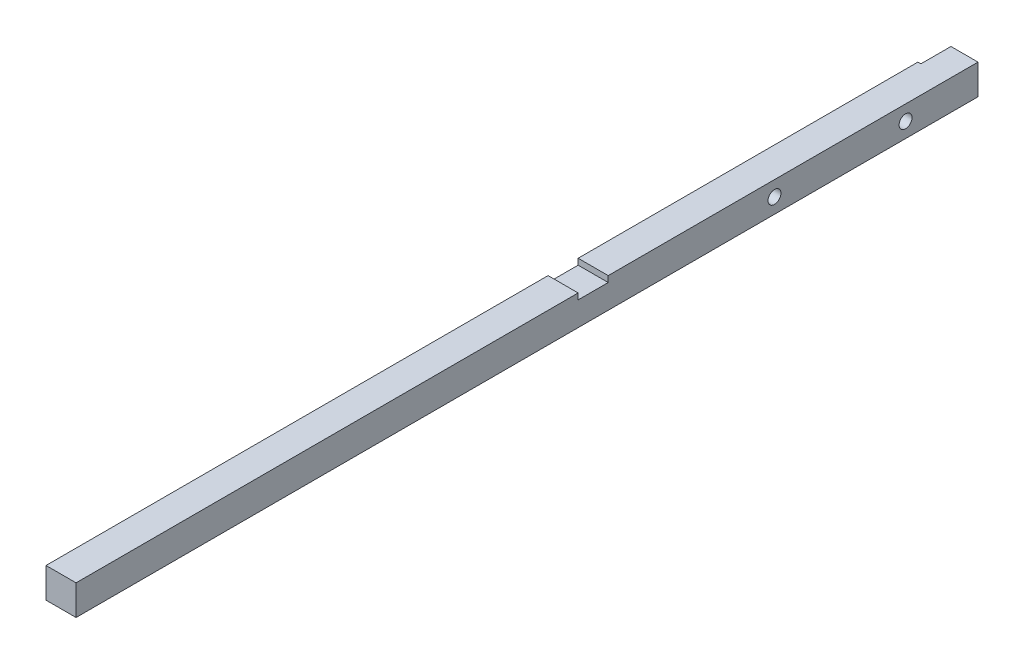
ISO-10303-21;
HEADER;
FILE_DESCRIPTION(('STEP AP214'),'2;1');
FILE_NAME('part.step','',(''),(''),'','','');
FILE_SCHEMA(('AUTOMOTIVE_DESIGN { 1 0 10303 214 1 1 1 1 }'));
ENDSEC;
DATA;
#1=APPLICATION_CONTEXT('core data for automotive mechanical design processes');
#2=APPLICATION_PROTOCOL_DEFINITION('international standard','automotive_design',2000,#1);
#3=PRODUCT_CONTEXT('',#1,'mechanical');
#4=PRODUCT('Part','Part','',(#3));
#5=PRODUCT_RELATED_PRODUCT_CATEGORY('part','',(#4));
#6=PRODUCT_DEFINITION_FORMATION('','',#4);
#7=PRODUCT_DEFINITION_CONTEXT('part definition',#1,'design');
#8=PRODUCT_DEFINITION('design','',#6,#7);
#9=PRODUCT_DEFINITION_SHAPE('','',#8);
#10=(LENGTH_UNIT() NAMED_UNIT(*) SI_UNIT(.MILLI.,.METRE.));
#11=(NAMED_UNIT(*) PLANE_ANGLE_UNIT() SI_UNIT($,.RADIAN.));
#12=(NAMED_UNIT(*) SI_UNIT($,.STERADIAN.) SOLID_ANGLE_UNIT());
#13=UNCERTAINTY_MEASURE_WITH_UNIT(LENGTH_MEASURE(1.E-05),#10,'distance_accuracy_value','');
#14=(GEOMETRIC_REPRESENTATION_CONTEXT(3) GLOBAL_UNCERTAINTY_ASSIGNED_CONTEXT((#13)) GLOBAL_UNIT_ASSIGNED_CONTEXT((#10,
#11,#12)) REPRESENTATION_CONTEXT('',''));
#15=CARTESIAN_POINT('',(0.,0.,0.));
#16=DIRECTION('',(0.,0.,1.));
#17=DIRECTION('',(1.,0.,0.));
#18=AXIS2_PLACEMENT_3D('',#15,#16,#17);
#19=CARTESIAN_POINT('',(-5.,5.,323.142135623731));
#20=DIRECTION('',(0.,-1.,0.));
#21=DIRECTION('',(0.,0.,-1.));
#22=AXIS2_PLACEMENT_3D('',#19,#20,#21);
#23=PLANE('',#22);
#24=DIRECTION('',(0.,0.,-1.));
#25=VECTOR('',#24,1.);
#26=CARTESIAN_POINT('',(5.,5.,323.142135623731));
#27=LINE('',#26,#25);
#28=CARTESIAN_POINT('',(5.,5.,307.));
#29=VERTEX_POINT('',#28);
#30=CARTESIAN_POINT('',(5.,5.,140.));
#31=VERTEX_POINT('',#30);
#32=EDGE_CURVE('E156',#29,#31,#27,.T.);
#33=ORIENTED_EDGE('',*,*,#32,.T.);
#34=DIRECTION('',(1.,0.,0.));
#35=VECTOR('',#34,1.);
#36=CARTESIAN_POINT('',(-5.,5.,140.));
#37=LINE('',#36,#35);
#38=CARTESIAN_POINT('',(-5.,5.,140.));
#39=VERTEX_POINT('',#38);
#40=EDGE_CURVE('E196',#39,#31,#37,.T.);
#41=ORIENTED_EDGE('',*,*,#40,.F.);
#42=DIRECTION('',(0.,0.,-1.));
#43=VECTOR('',#42,1.);
#44=CARTESIAN_POINT('',(-5.,5.,323.142135623731));
#45=LINE('',#44,#43);
#46=CARTESIAN_POINT('',(-5.,5.,307.));
#47=VERTEX_POINT('',#46);
#48=EDGE_CURVE('E42',#47,#39,#45,.T.);
#49=ORIENTED_EDGE('',*,*,#48,.F.);
#50=DIRECTION('',(-1.,0.,0.));
#51=VECTOR('',#50,1.);
#52=CARTESIAN_POINT('',(-5.,5.,307.));
#53=LINE('',#52,#51);
#54=EDGE_CURVE('E153',#29,#47,#53,.T.);
#55=ORIENTED_EDGE('',*,*,#54,.F.);
#56=EDGE_LOOP('',(#33,#41,#49,#55));
#57=FACE_BOUND('',#56,.T.);
#58=ADVANCED_FACE('F38',(#57),#23,.F.);
#59=CARTESIAN_POINT('',(-5.,5.,323.142135623731));
#60=DIRECTION('',(1.,0.,0.));
#61=DIRECTION('',(0.,1.,0.));
#62=AXIS2_PLACEMENT_3D('',#59,#60,#61);
#63=PLANE('',#62);
#64=CARTESIAN_POINT('',(-5.,0.,74.69));
#65=DIRECTION('',(-1.,0.,0.));
#66=DIRECTION('',(0.,0.,1.));
#67=AXIS2_PLACEMENT_3D('',#64,#65,#66);
#68=CIRCLE('',#67,2.14999999999999);
#69=CARTESIAN_POINT('',(-5.,0.,76.84));
#70=VERTEX_POINT('',#69);
#71=EDGE_CURVE('E260',#70,#70,#68,.T.);
#72=ORIENTED_EDGE('',*,*,#71,.F.);
#73=EDGE_LOOP('',(#72));
#74=FACE_BOUND('',#73,.T.);
#75=CARTESIAN_POINT('',(-5.,0.,31.09));
#76=DIRECTION('',(-1.,0.,0.));
#77=DIRECTION('',(0.,0.,1.));
#78=AXIS2_PLACEMENT_3D('',#75,#76,#77);
#79=CIRCLE('',#78,2.14999999999999);
#80=CARTESIAN_POINT('',(-5.,0.,33.24));
#81=VERTEX_POINT('',#80);
#82=EDGE_CURVE('E254',#81,#81,#79,.T.);
#83=ORIENTED_EDGE('',*,*,#82,.F.);
#84=EDGE_LOOP('',(#83));
#85=FACE_BOUND('',#84,.T.);
#86=CARTESIAN_POINT('',(-5.,5.,130.));
#87=VERTEX_POINT('',#86);
#88=CARTESIAN_POINT('',(-5.,4.99999999999999,17.));
#89=VERTEX_POINT('',#88);
#90=EDGE_CURVE('E198',#87,#89,#45,.T.);
#91=ORIENTED_EDGE('',*,*,#90,.T.);
#92=DIRECTION('',(0.,1.,0.));
#93=VECTOR('',#92,1.);
#94=CARTESIAN_POINT('',(-5.,-5.,17.));
#95=LINE('',#94,#93);
#96=CARTESIAN_POINT('',(-5.,-5.,17.));
#97=VERTEX_POINT('',#96);
#98=EDGE_CURVE('E125',#97,#89,#95,.T.);
#99=ORIENTED_EDGE('',*,*,#98,.F.);
#100=DIRECTION('',(0.,0.,-1.));
#101=VECTOR('',#100,1.);
#102=CARTESIAN_POINT('',(-5.,-5.,323.142135623731));
#103=LINE('',#102,#101);
#104=CARTESIAN_POINT('',(-5.,-5.,307.));
#105=VERTEX_POINT('',#104);
#106=EDGE_CURVE('E141',#105,#97,#103,.T.);
#107=ORIENTED_EDGE('',*,*,#106,.F.);
#108=DIRECTION('',(0.,-1.,0.));
#109=VECTOR('',#108,1.);
#110=CARTESIAN_POINT('',(-5.,5.,307.));
#111=LINE('',#110,#109);
#112=EDGE_CURVE('E150',#47,#105,#111,.T.);
#113=ORIENTED_EDGE('',*,*,#112,.F.);
#114=ORIENTED_EDGE('',*,*,#48,.T.);
#115=DIRECTION('',(0.,-1.,0.));
#116=VECTOR('',#115,1.);
#117=CARTESIAN_POINT('',(-5.,5.,140.));
#118=LINE('',#117,#116);
#119=CARTESIAN_POINT('',(-5.,3.,140.));
#120=VERTEX_POINT('',#119);
#121=EDGE_CURVE('E180',#39,#120,#118,.T.);
#122=ORIENTED_EDGE('',*,*,#121,.T.);
#123=DIRECTION('',(0.,0.,-1.));
#124=VECTOR('',#123,1.);
#125=CARTESIAN_POINT('',(-5.,3.,140.));
#126=LINE('',#125,#124);
#127=CARTESIAN_POINT('',(-5.,3.,130.));
#128=VERTEX_POINT('',#127);
#129=EDGE_CURVE('E183',#120,#128,#126,.T.);
#130=ORIENTED_EDGE('',*,*,#129,.T.);
#131=DIRECTION('',(0.,1.,0.));
#132=VECTOR('',#131,1.);
#133=CARTESIAN_POINT('',(-5.,5.,130.));
#134=LINE('',#133,#132);
#135=EDGE_CURVE('E186',#128,#87,#134,.T.);
#136=ORIENTED_EDGE('',*,*,#135,.T.);
#137=EDGE_LOOP('',(#91,#99,#107,#113,#114,#122,#130,#136));
#138=FACE_BOUND('',#137,.T.);
#139=ADVANCED_FACE('F215',(#74,#85,#138),#63,.F.);
#140=CARTESIAN_POINT('',(-5.,-5.,323.142135623731));
#141=DIRECTION('',(0.,1.,0.));
#142=DIRECTION('',(0.,0.,1.));
#143=AXIS2_PLACEMENT_3D('',#140,#141,#142);
#144=PLANE('',#143);
#145=ORIENTED_EDGE('',*,*,#106,.T.);
#146=DIRECTION('',(-1.,0.,0.));
#147=VECTOR('',#146,1.);
#148=CARTESIAN_POINT('',(-4.,-5.,17.));
#149=LINE('',#148,#147);
#150=CARTESIAN_POINT('',(-4.,-5.,17.));
#151=VERTEX_POINT('',#150);
#152=EDGE_CURVE('E133',#151,#97,#149,.T.);
#153=ORIENTED_EDGE('',*,*,#152,.F.);
#154=DIRECTION('',(0.,0.,1.));
#155=VECTOR('',#154,1.);
#156=CARTESIAN_POINT('',(-4.,-5.,7.));
#157=LINE('',#156,#155);
#158=CARTESIAN_POINT('',(-4.,-5.,7.));
#159=VERTEX_POINT('',#158);
#160=EDGE_CURVE('E119',#159,#151,#157,.T.);
#161=ORIENTED_EDGE('',*,*,#160,.F.);
#162=DIRECTION('',(1.,0.,0.));
#163=VECTOR('',#162,1.);
#164=CARTESIAN_POINT('',(-5.,-5.,7.));
#165=LINE('',#164,#163);
#166=CARTESIAN_POINT('',(5.,-5.,7.));
#167=VERTEX_POINT('',#166);
#168=EDGE_CURVE('E131',#159,#167,#165,.T.);
#169=ORIENTED_EDGE('',*,*,#168,.T.);
#170=DIRECTION('',(0.,0.,-1.));
#171=VECTOR('',#170,1.);
#172=CARTESIAN_POINT('',(5.,-5.,323.142135623731));
#173=LINE('',#172,#171);
#174=CARTESIAN_POINT('',(5.,-5.,307.));
#175=VERTEX_POINT('',#174);
#176=EDGE_CURVE('E140',#175,#167,#173,.T.);
#177=ORIENTED_EDGE('',*,*,#176,.F.);
#178=DIRECTION('',(1.,0.,0.));
#179=VECTOR('',#178,1.);
#180=CARTESIAN_POINT('',(-5.,-5.,307.));
#181=LINE('',#180,#179);
#182=EDGE_CURVE('E47',#105,#175,#181,.T.);
#183=ORIENTED_EDGE('',*,*,#182,.F.);
#184=EDGE_LOOP('',(#145,#153,#161,#169,#177,#183));
#185=FACE_BOUND('',#184,.T.);
#186=ADVANCED_FACE('F129',(#185),#144,.F.);
#187=CARTESIAN_POINT('',(5.,5.,323.142135623731));
#188=DIRECTION('',(-1.,0.,0.));
#189=DIRECTION('',(0.,-1.,0.));
#190=AXIS2_PLACEMENT_3D('',#187,#188,#189);
#191=PLANE('',#190);
#192=CARTESIAN_POINT('',(5.,0.,74.69));
#193=DIRECTION('',(-1.,0.,0.));
#194=DIRECTION('',(0.,0.,1.));
#195=AXIS2_PLACEMENT_3D('',#192,#193,#194);
#196=CIRCLE('',#195,2.15);
#197=CARTESIAN_POINT('',(5.,0.,76.84));
#198=VERTEX_POINT('',#197);
#199=EDGE_CURVE('E250',#198,#198,#196,.T.);
#200=ORIENTED_EDGE('',*,*,#199,.T.);
#201=EDGE_LOOP('',(#200));
#202=FACE_BOUND('',#201,.T.);
#203=CARTESIAN_POINT('',(5.,0.,31.09));
#204=DIRECTION('',(-1.,0.,0.));
#205=DIRECTION('',(0.,0.,1.));
#206=AXIS2_PLACEMENT_3D('',#203,#204,#205);
#207=CIRCLE('',#206,2.15);
#208=CARTESIAN_POINT('',(5.,0.,33.24));
#209=VERTEX_POINT('',#208);
#210=EDGE_CURVE('E177',#209,#209,#207,.T.);
#211=ORIENTED_EDGE('',*,*,#210,.T.);
#212=EDGE_LOOP('',(#211));
#213=FACE_BOUND('',#212,.T.);
#214=DIRECTION('',(0.,0.,-1.));
#215=VECTOR('',#214,1.);
#216=CARTESIAN_POINT('',(5.,3.,140.));
#217=LINE('',#216,#215);
#218=CARTESIAN_POINT('',(5.,3.,140.));
#219=VERTEX_POINT('',#218);
#220=CARTESIAN_POINT('',(5.,3.,130.));
#221=VERTEX_POINT('',#220);
#222=EDGE_CURVE('E192',#219,#221,#217,.T.);
#223=ORIENTED_EDGE('',*,*,#222,.F.);
#224=DIRECTION('',(0.,-1.,0.));
#225=VECTOR('',#224,1.);
#226=CARTESIAN_POINT('',(5.,5.,140.));
#227=LINE('',#226,#225);
#228=EDGE_CURVE('E178',#31,#219,#227,.T.);
#229=ORIENTED_EDGE('',*,*,#228,.F.);
#230=ORIENTED_EDGE('',*,*,#32,.F.);
#231=DIRECTION('',(0.,1.,0.));
#232=VECTOR('',#231,1.);
#233=CARTESIAN_POINT('',(5.,5.,307.));
#234=LINE('',#233,#232);
#235=EDGE_CURVE('E12',#175,#29,#234,.T.);
#236=ORIENTED_EDGE('',*,*,#235,.F.);
#237=ORIENTED_EDGE('',*,*,#176,.T.);
#238=DIRECTION('',(0.,1.,0.));
#239=VECTOR('',#238,1.);
#240=CARTESIAN_POINT('',(5.,5.,7.));
#241=LINE('',#240,#239);
#242=CARTESIAN_POINT('',(5.,5.,7.));
#243=VERTEX_POINT('',#242);
#244=EDGE_CURVE('E139',#167,#243,#241,.T.);
#245=ORIENTED_EDGE('',*,*,#244,.T.);
#246=CARTESIAN_POINT('',(5.,5.,130.));
#247=VERTEX_POINT('',#246);
#248=EDGE_CURVE('E158',#247,#243,#27,.T.);
#249=ORIENTED_EDGE('',*,*,#248,.F.);
#250=DIRECTION('',(0.,1.,0.));
#251=VECTOR('',#250,1.);
#252=CARTESIAN_POINT('',(5.,5.,130.));
#253=LINE('',#252,#251);
#254=EDGE_CURVE('E63',#221,#247,#253,.T.);
#255=ORIENTED_EDGE('',*,*,#254,.F.);
#256=EDGE_LOOP('',(#223,#229,#230,#236,#237,#245,#249,#255));
#257=FACE_BOUND('',#256,.T.);
#258=ADVANCED_FACE('F166',(#202,#213,#257),#191,.F.);
#259=DIRECTION('',(0.,0.,-1.));
#260=VECTOR('',#259,1.);
#261=CARTESIAN_POINT('',(-4.,4.99999999999999,7.));
#262=LINE('',#261,#260);
#263=CARTESIAN_POINT('',(-4.,4.99999999999999,17.));
#264=VERTEX_POINT('',#263);
#265=CARTESIAN_POINT('',(-4.,5.,7.));
#266=VERTEX_POINT('',#265);
#267=EDGE_CURVE('E55',#264,#266,#262,.T.);
#268=ORIENTED_EDGE('',*,*,#267,.F.);
#269=DIRECTION('',(-1.,0.,0.));
#270=VECTOR('',#269,1.);
#271=CARTESIAN_POINT('',(-4.,4.99999999999999,17.));
#272=LINE('',#271,#270);
#273=EDGE_CURVE('E170',#264,#89,#272,.T.);
#274=ORIENTED_EDGE('',*,*,#273,.T.);
#275=ORIENTED_EDGE('',*,*,#90,.F.);
#276=DIRECTION('',(1.,0.,0.));
#277=VECTOR('',#276,1.);
#278=CARTESIAN_POINT('',(-5.,5.,130.));
#279=LINE('',#278,#277);
#280=EDGE_CURVE('E199',#87,#247,#279,.T.);
#281=ORIENTED_EDGE('',*,*,#280,.T.);
#282=ORIENTED_EDGE('',*,*,#248,.T.);
#283=DIRECTION('',(-1.,0.,0.));
#284=VECTOR('',#283,1.);
#285=CARTESIAN_POINT('',(-5.,5.,7.));
#286=LINE('',#285,#284);
#287=EDGE_CURVE('E155',#243,#266,#286,.T.);
#288=ORIENTED_EDGE('',*,*,#287,.T.);
#289=EDGE_LOOP('',(#268,#274,#275,#281,#282,#288));
#290=FACE_BOUND('',#289,.T.);
#291=ADVANCED_FACE('F167',(#290),#23,.F.);
#292=CARTESIAN_POINT('',(0.,0.,7.));
#293=DIRECTION('',(0.,0.,1.));
#294=DIRECTION('',(1.,0.,0.));
#295=AXIS2_PLACEMENT_3D('',#292,#293,#294);
#296=PLANE('',#295);
#297=ORIENTED_EDGE('',*,*,#168,.F.);
#298=DIRECTION('',(0.,-1.,0.));
#299=VECTOR('',#298,1.);
#300=CARTESIAN_POINT('',(-4.,-5.,7.));
#301=LINE('',#300,#299);
#302=EDGE_CURVE('E116',#266,#159,#301,.T.);
#303=ORIENTED_EDGE('',*,*,#302,.F.);
#304=ORIENTED_EDGE('',*,*,#287,.F.);
#305=ORIENTED_EDGE('',*,*,#244,.F.);
#306=EDGE_LOOP('',(#297,#303,#304,#305));
#307=FACE_BOUND('',#306,.T.);
#308=ADVANCED_FACE('F137',(#307),#296,.F.);
#309=CARTESIAN_POINT('',(5.,247.,307.));
#310=DIRECTION('',(0.,0.,1.));
#311=DIRECTION('',(0.,1.,0.));
#312=AXIS2_PLACEMENT_3D('',#309,#310,#311);
#313=PLANE('',#312);
#314=ORIENTED_EDGE('',*,*,#54,.T.);
#315=ORIENTED_EDGE('',*,*,#112,.T.);
#316=ORIENTED_EDGE('',*,*,#182,.T.);
#317=ORIENTED_EDGE('',*,*,#235,.T.);
#318=EDGE_LOOP('',(#314,#315,#316,#317));
#319=FACE_BOUND('',#318,.T.);
#320=ADVANCED_FACE('F40',(#319),#313,.T.);
#321=CARTESIAN_POINT('',(-5.,5.,140.));
#322=DIRECTION('',(0.,0.,1.));
#323=DIRECTION('',(1.,0.,0.));
#324=AXIS2_PLACEMENT_3D('',#321,#322,#323);
#325=PLANE('',#324);
#326=ORIENTED_EDGE('',*,*,#228,.T.);
#327=DIRECTION('',(1.,0.,0.));
#328=VECTOR('',#327,1.);
#329=CARTESIAN_POINT('',(-5.,3.,140.));
#330=LINE('',#329,#328);
#331=EDGE_CURVE('E189',#120,#219,#330,.T.);
#332=ORIENTED_EDGE('',*,*,#331,.F.);
#333=ORIENTED_EDGE('',*,*,#121,.F.);
#334=ORIENTED_EDGE('',*,*,#40,.T.);
#335=EDGE_LOOP('',(#326,#332,#333,#334));
#336=FACE_BOUND('',#335,.T.);
#337=ADVANCED_FACE('F208',(#336),#325,.F.);
#338=CARTESIAN_POINT('',(-5.,5.,130.));
#339=DIRECTION('',(0.,0.,-1.));
#340=DIRECTION('',(-1.,0.,0.));
#341=AXIS2_PLACEMENT_3D('',#338,#339,#340);
#342=PLANE('',#341);
#343=ORIENTED_EDGE('',*,*,#254,.T.);
#344=ORIENTED_EDGE('',*,*,#280,.F.);
#345=ORIENTED_EDGE('',*,*,#135,.F.);
#346=DIRECTION('',(1.,0.,0.));
#347=VECTOR('',#346,1.);
#348=CARTESIAN_POINT('',(-5.,3.,130.));
#349=LINE('',#348,#347);
#350=EDGE_CURVE('E201',#128,#221,#349,.T.);
#351=ORIENTED_EDGE('',*,*,#350,.T.);
#352=EDGE_LOOP('',(#343,#344,#345,#351));
#353=FACE_BOUND('',#352,.T.);
#354=ADVANCED_FACE('F226',(#353),#342,.F.);
#355=CARTESIAN_POINT('',(-5.,3.,140.));
#356=DIRECTION('',(0.,-1.,0.));
#357=DIRECTION('',(0.,0.,-1.));
#358=AXIS2_PLACEMENT_3D('',#355,#356,#357);
#359=PLANE('',#358);
#360=ORIENTED_EDGE('',*,*,#222,.T.);
#361=ORIENTED_EDGE('',*,*,#350,.F.);
#362=ORIENTED_EDGE('',*,*,#129,.F.);
#363=ORIENTED_EDGE('',*,*,#331,.T.);
#364=EDGE_LOOP('',(#360,#361,#362,#363));
#365=FACE_BOUND('',#364,.T.);
#366=ADVANCED_FACE('F205',(#365),#359,.F.);
#367=CARTESIAN_POINT('',(-4.,-5.,17.));
#368=DIRECTION('',(0.,0.,1.));
#369=DIRECTION('',(1.,0.,0.));
#370=AXIS2_PLACEMENT_3D('',#367,#368,#369);
#371=PLANE('',#370);
#372=ORIENTED_EDGE('',*,*,#98,.T.);
#373=ORIENTED_EDGE('',*,*,#273,.F.);
#374=DIRECTION('',(0.,1.,0.));
#375=VECTOR('',#374,1.);
#376=CARTESIAN_POINT('',(-4.,-5.,17.));
#377=LINE('',#376,#375);
#378=EDGE_CURVE('E134',#151,#264,#377,.T.);
#379=ORIENTED_EDGE('',*,*,#378,.F.);
#380=ORIENTED_EDGE('',*,*,#152,.T.);
#381=EDGE_LOOP('',(#372,#373,#379,#380));
#382=FACE_BOUND('',#381,.T.);
#383=ADVANCED_FACE('F217',(#382),#371,.F.);
#384=CARTESIAN_POINT('',(-4.,0.,0.));
#385=DIRECTION('',(1.,0.,0.));
#386=DIRECTION('',(0.,0.,-1.));
#387=AXIS2_PLACEMENT_3D('',#384,#385,#386);
#388=PLANE('',#387);
#389=ORIENTED_EDGE('',*,*,#302,.T.);
#390=ORIENTED_EDGE('',*,*,#160,.T.);
#391=ORIENTED_EDGE('',*,*,#378,.T.);
#392=ORIENTED_EDGE('',*,*,#267,.T.);
#393=EDGE_LOOP('',(#389,#390,#391,#392));
#394=FACE_BOUND('',#393,.T.);
#395=ADVANCED_FACE('F118',(#394),#388,.F.);
#396=CARTESIAN_POINT('',(-5.,0.,31.09));
#397=DIRECTION('',(-1.,0.,0.));
#398=DIRECTION('',(0.,0.,1.));
#399=AXIS2_PLACEMENT_3D('',#396,#397,#398);
#400=CYLINDRICAL_SURFACE('',#399,2.14999999999999);
#401=ORIENTED_EDGE('',*,*,#210,.F.);
#402=EDGE_LOOP('',(#401));
#403=FACE_BOUND('',#402,.T.);
#404=ORIENTED_EDGE('',*,*,#82,.T.);
#405=EDGE_LOOP('',(#404));
#406=FACE_BOUND('',#405,.T.);
#407=ADVANCED_FACE('F224',(#403,#406),#400,.F.);
#408=CARTESIAN_POINT('',(-5.,0.,74.69));
#409=DIRECTION('',(-1.,0.,0.));
#410=DIRECTION('',(0.,0.,1.));
#411=AXIS2_PLACEMENT_3D('',#408,#409,#410);
#412=CYLINDRICAL_SURFACE('',#411,2.14999999999999);
#413=ORIENTED_EDGE('',*,*,#199,.F.);
#414=EDGE_LOOP('',(#413));
#415=FACE_BOUND('',#414,.T.);
#416=ORIENTED_EDGE('',*,*,#71,.T.);
#417=EDGE_LOOP('',(#416));
#418=FACE_BOUND('',#417,.T.);
#419=ADVANCED_FACE('F264',(#415,#418),#412,.F.);
#420=CLOSED_SHELL('',(#58,#139,#186,#258,#291,#308,#320,#337,#354,#366,#383,#395,#407,#419));
#421=MANIFOLD_SOLID_BREP('B2',#420);
#422=ADVANCED_BREP_SHAPE_REPRESENTATION('',(#18,#421),#14);
#423=SHAPE_DEFINITION_REPRESENTATION(#9,#422);
ENDSEC;
END-ISO-10303-21;
